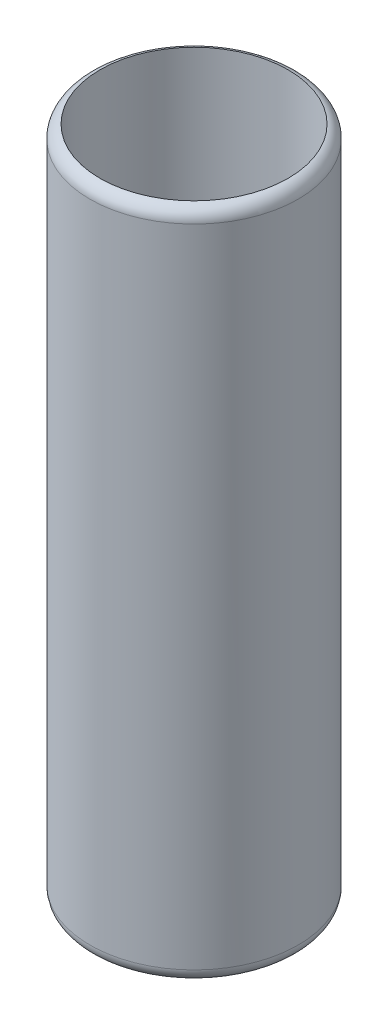
ISO-10303-21;
HEADER;
FILE_DESCRIPTION(('STEP AP214'),'2;1');
FILE_NAME('part.step','',(''),(''),'','','');
FILE_SCHEMA(('AUTOMOTIVE_DESIGN { 1 0 10303 214 1 1 1 1 }'));
ENDSEC;
DATA;
#1=APPLICATION_CONTEXT('core data for automotive mechanical design processes');
#2=APPLICATION_PROTOCOL_DEFINITION('international standard','automotive_design',2000,#1);
#3=PRODUCT_CONTEXT('',#1,'mechanical');
#4=PRODUCT('Part','Part','',(#3));
#5=PRODUCT_RELATED_PRODUCT_CATEGORY('part','',(#4));
#6=PRODUCT_DEFINITION_FORMATION('','',#4);
#7=PRODUCT_DEFINITION_CONTEXT('part definition',#1,'design');
#8=PRODUCT_DEFINITION('design','',#6,#7);
#9=PRODUCT_DEFINITION_SHAPE('','',#8);
#10=(LENGTH_UNIT() NAMED_UNIT(*) SI_UNIT(.MILLI.,.METRE.));
#11=(NAMED_UNIT(*) PLANE_ANGLE_UNIT() SI_UNIT($,.RADIAN.));
#12=(NAMED_UNIT(*) SI_UNIT($,.STERADIAN.) SOLID_ANGLE_UNIT());
#13=UNCERTAINTY_MEASURE_WITH_UNIT(LENGTH_MEASURE(1.E-05),#10,'distance_accuracy_value','');
#14=(GEOMETRIC_REPRESENTATION_CONTEXT(3) GLOBAL_UNCERTAINTY_ASSIGNED_CONTEXT((#13)) GLOBAL_UNIT_ASSIGNED_CONTEXT((#10,
#11,#12)) REPRESENTATION_CONTEXT('',''));
#15=CARTESIAN_POINT('',(0.,0.,0.));
#16=DIRECTION('',(0.,0.,1.));
#17=DIRECTION('',(1.,0.,0.));
#18=AXIS2_PLACEMENT_3D('',#15,#16,#17);
#19=CARTESIAN_POINT('',(0.,100.,0.));
#20=DIRECTION('',(0.,-1.,0.));
#21=DIRECTION('',(0.,0.,-1.));
#22=AXIS2_PLACEMENT_3D('',#19,#20,#21);
#23=CYLINDRICAL_SURFACE('',#22,15.5);
#24=CARTESIAN_POINT('',(0.,1.93649167310371,0.));
#25=DIRECTION('',(0.,-1.,0.));
#26=DIRECTION('',(0.,0.,-1.));
#27=AXIS2_PLACEMENT_3D('',#24,#25,#26);
#28=CIRCLE('',#27,15.5);
#29=CARTESIAN_POINT('',(0.,1.93649167310371,-15.5));
#30=VERTEX_POINT('',#29);
#31=EDGE_CURVE('E10',#30,#30,#28,.F.);
#32=ORIENTED_EDGE('',*,*,#31,.T.);
#33=EDGE_LOOP('',(#32));
#34=FACE_BOUND('',#33,.T.);
#35=CARTESIAN_POINT('',(0.,98.0635083268963,0.));
#36=DIRECTION('',(0.,1.,0.));
#37=DIRECTION('',(0.,0.,1.));
#38=AXIS2_PLACEMENT_3D('',#35,#36,#37);
#39=CIRCLE('',#38,15.5);
#40=CARTESIAN_POINT('',(0.,98.0635083268963,15.5));
#41=VERTEX_POINT('',#40);
#42=EDGE_CURVE('E41',#41,#41,#39,.F.);
#43=ORIENTED_EDGE('',*,*,#42,.T.);
#44=EDGE_LOOP('',(#43));
#45=FACE_BOUND('',#44,.T.);
#46=ADVANCED_FACE('F34',(#34,#45),#23,.T.);
#47=CARTESIAN_POINT('',(0.,100.,0.));
#48=DIRECTION('',(0.,-1.,0.));
#49=DIRECTION('',(0.,0.,-1.));
#50=AXIS2_PLACEMENT_3D('',#47,#48,#49);
#51=CYLINDRICAL_SURFACE('',#50,14.);
#52=CARTESIAN_POINT('',(0.,100.,0.));
#53=DIRECTION('',(0.,1.,0.));
#54=DIRECTION('',(0.,0.,1.));
#55=AXIS2_PLACEMENT_3D('',#52,#53,#54);
#56=CIRCLE('',#55,14.);
#57=CARTESIAN_POINT('',(0.,100.,14.));
#58=VERTEX_POINT('',#57);
#59=EDGE_CURVE('E45',#58,#58,#56,.T.);
#60=ORIENTED_EDGE('',*,*,#59,.T.);
#61=EDGE_LOOP('',(#60));
#62=FACE_BOUND('',#61,.T.);
#63=CARTESIAN_POINT('',(0.,0.,0.));
#64=DIRECTION('',(0.,1.,0.));
#65=DIRECTION('',(0.,0.,1.));
#66=AXIS2_PLACEMENT_3D('',#63,#64,#65);
#67=CIRCLE('',#66,14.);
#68=CARTESIAN_POINT('',(0.,0.,14.));
#69=VERTEX_POINT('',#68);
#70=EDGE_CURVE('E49',#69,#69,#67,.T.);
#71=ORIENTED_EDGE('',*,*,#70,.F.);
#72=EDGE_LOOP('',(#71));
#73=FACE_BOUND('',#72,.T.);
#74=ADVANCED_FACE('F58',(#62,#73),#51,.F.);
#75=CARTESIAN_POINT('',(0.,1.93649167310371,0.));
#76=DIRECTION('',(0.,-1.,0.));
#77=DIRECTION('',(0.,0.,-1.));
#78=AXIS2_PLACEMENT_3D('',#75,#76,#77);
#79=TOROIDAL_SURFACE('',#78,13.5,2.);
#80=ORIENTED_EDGE('',*,*,#70,.T.);
#81=EDGE_LOOP('',(#80));
#82=FACE_BOUND('',#81,.T.);
#83=ORIENTED_EDGE('',*,*,#31,.F.);
#84=EDGE_LOOP('',(#83));
#85=FACE_BOUND('',#84,.T.);
#86=ADVANCED_FACE('F55',(#82,#85),#79,.T.);
#87=CARTESIAN_POINT('',(0.,98.0635083268963,0.));
#88=DIRECTION('',(0.,1.,0.));
#89=DIRECTION('',(0.,0.,1.));
#90=AXIS2_PLACEMENT_3D('',#87,#88,#89);
#91=TOROIDAL_SURFACE('',#90,13.5,2.);
#92=ORIENTED_EDGE('',*,*,#42,.F.);
#93=EDGE_LOOP('',(#92));
#94=FACE_BOUND('',#93,.T.);
#95=ORIENTED_EDGE('',*,*,#59,.F.);
#96=EDGE_LOOP('',(#95));
#97=FACE_BOUND('',#96,.T.);
#98=ADVANCED_FACE('F36',(#94,#97),#91,.T.);
#99=CLOSED_SHELL('',(#46,#74,#86,#98));
#100=MANIFOLD_SOLID_BREP('B2',#99);
#101=ADVANCED_BREP_SHAPE_REPRESENTATION('',(#18,#100),#14);
#102=SHAPE_DEFINITION_REPRESENTATION(#9,#101);
ENDSEC;
END-ISO-10303-21;
